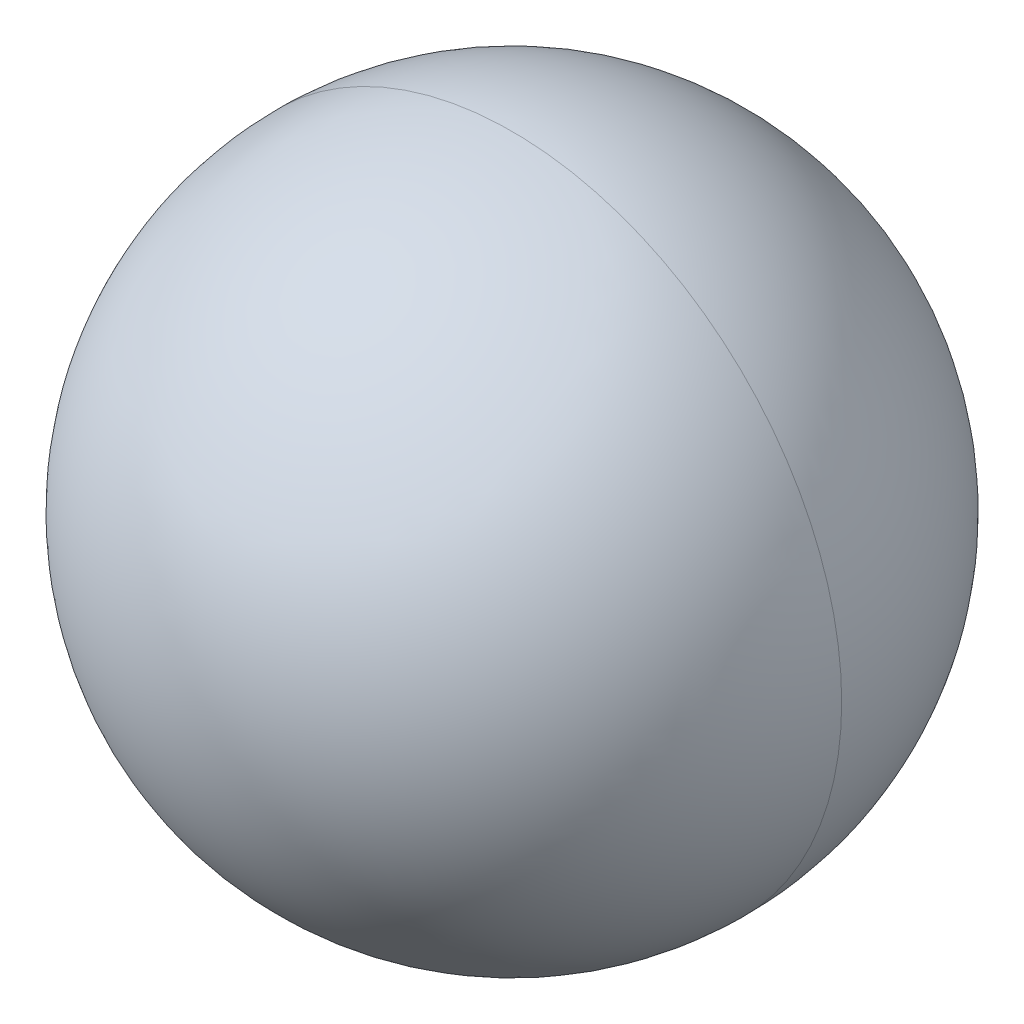
ISO-10303-21;
HEADER;
FILE_DESCRIPTION(('STEP AP214'),'2;1');
FILE_NAME('part.step','',(''),(''),'','','');
FILE_SCHEMA(('AUTOMOTIVE_DESIGN { 1 0 10303 214 1 1 1 1 }'));
ENDSEC;
DATA;
#1=APPLICATION_CONTEXT('core data for automotive mechanical design processes');
#2=APPLICATION_PROTOCOL_DEFINITION('international standard','automotive_design',2000,#1);
#3=PRODUCT_CONTEXT('',#1,'mechanical');
#4=PRODUCT('Part','Part','',(#3));
#5=PRODUCT_RELATED_PRODUCT_CATEGORY('part','',(#4));
#6=PRODUCT_DEFINITION_FORMATION('','',#4);
#7=PRODUCT_DEFINITION_CONTEXT('part definition',#1,'design');
#8=PRODUCT_DEFINITION('design','',#6,#7);
#9=PRODUCT_DEFINITION_SHAPE('','',#8);
#10=(LENGTH_UNIT() NAMED_UNIT(*) SI_UNIT(.MILLI.,.METRE.));
#11=(NAMED_UNIT(*) PLANE_ANGLE_UNIT() SI_UNIT($,.RADIAN.));
#12=(NAMED_UNIT(*) SI_UNIT($,.STERADIAN.) SOLID_ANGLE_UNIT());
#13=UNCERTAINTY_MEASURE_WITH_UNIT(LENGTH_MEASURE(1.E-05),#10,'distance_accuracy_value','');
#14=(GEOMETRIC_REPRESENTATION_CONTEXT(3) GLOBAL_UNCERTAINTY_ASSIGNED_CONTEXT((#13)) GLOBAL_UNIT_ASSIGNED_CONTEXT((#10,
#11,#12)) REPRESENTATION_CONTEXT('',''));
#15=CARTESIAN_POINT('',(0.,0.,0.));
#16=DIRECTION('',(0.,0.,1.));
#17=DIRECTION('',(1.,0.,0.));
#18=AXIS2_PLACEMENT_3D('',#15,#16,#17);
#19=CARTESIAN_POINT('',(6.,14.25,0.));
#20=DIRECTION('',(1.,0.,0.));
#21=DIRECTION('',(0.,0.,-1.));
#22=AXIS2_PLACEMENT_3D('',#19,#20,#21);
#23=SPHERICAL_SURFACE('',#22,3.572);
#24=CARTESIAN_POINT('',(6.,14.25,0.));
#25=DIRECTION('',(0.,0.,1.));
#26=DIRECTION('',(1.,0.,0.));
#27=AXIS2_PLACEMENT_3D('',#24,#25,#26);
#28=CIRCLE('',#27,3.572);
#29=CARTESIAN_POINT('',(9.572,14.25,0.));
#30=VERTEX_POINT('',#29);
#31=CARTESIAN_POINT('',(2.428,14.25,0.));
#32=VERTEX_POINT('',#31);
#33=EDGE_CURVE('E11',#30,#32,#28,.T.);
#34=ORIENTED_EDGE('',*,*,#33,.T.);
#35=CARTESIAN_POINT('',(6.,14.25,0.));
#36=DIRECTION('',(0.,0.,-1.));
#37=DIRECTION('',(1.,0.,0.));
#38=AXIS2_PLACEMENT_3D('',#35,#36,#37);
#39=CIRCLE('',#38,3.572);
#40=EDGE_CURVE('E25',#30,#32,#39,.T.);
#41=ORIENTED_EDGE('',*,*,#40,.F.);
#42=EDGE_LOOP('',(#34,#41));
#43=FACE_BOUND('',#42,.T.);
#44=ADVANCED_FACE('F17',(#43),#23,.T.);
#45=CARTESIAN_POINT('',(6.,14.25,0.));
#46=DIRECTION('',(1.,0.,0.));
#47=DIRECTION('',(0.,0.,1.));
#48=AXIS2_PLACEMENT_3D('',#45,#46,#47);
#49=SPHERICAL_SURFACE('',#48,3.572);
#50=ORIENTED_EDGE('',*,*,#33,.F.);
#51=ORIENTED_EDGE('',*,*,#40,.T.);
#52=EDGE_LOOP('',(#50,#51));
#53=FACE_BOUND('',#52,.T.);
#54=ADVANCED_FACE('F33',(#53),#49,.T.);
#55=CLOSED_SHELL('',(#44,#54));
#56=MANIFOLD_SOLID_BREP('B1',#55);
#57=ADVANCED_BREP_SHAPE_REPRESENTATION('',(#18,#56),#14);
#58=SHAPE_DEFINITION_REPRESENTATION(#9,#57);
ENDSEC;
END-ISO-10303-21;
